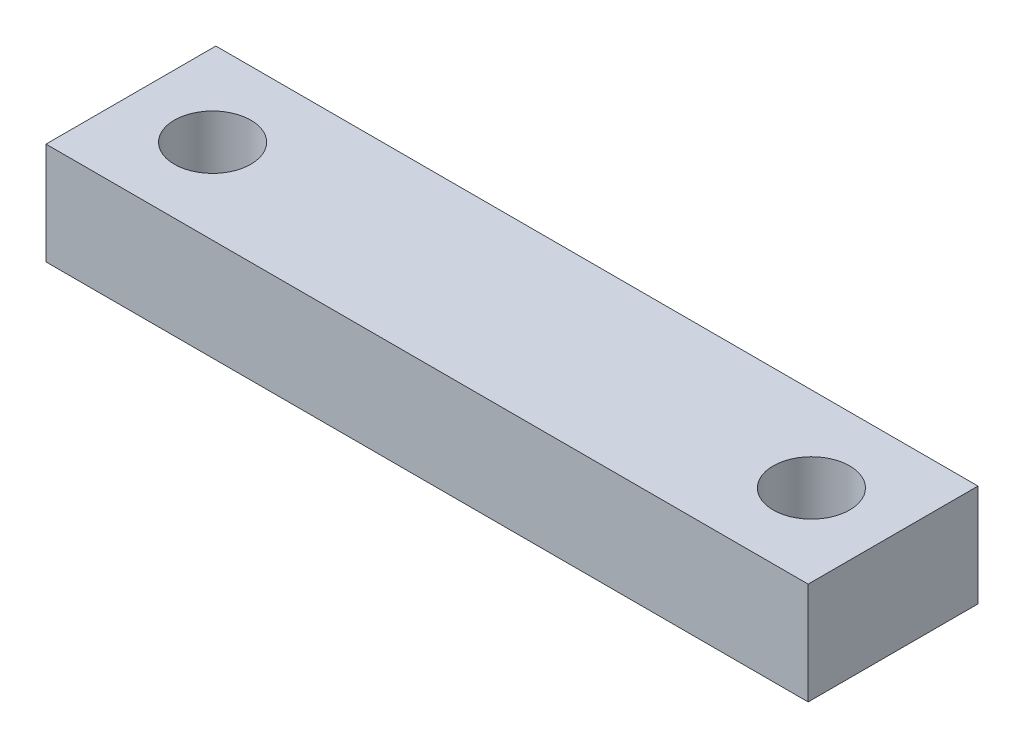
ISO-10303-21;
HEADER;
FILE_DESCRIPTION(('STEP AP214'),'2;1');
FILE_NAME('part.step','',(''),(''),'','','');
FILE_SCHEMA(('AUTOMOTIVE_DESIGN { 1 0 10303 214 1 1 1 1 }'));
ENDSEC;
DATA;
#1=APPLICATION_CONTEXT('core data for automotive mechanical design processes');
#2=APPLICATION_PROTOCOL_DEFINITION('international standard','automotive_design',2000,#1);
#3=PRODUCT_CONTEXT('',#1,'mechanical');
#4=PRODUCT('Part','Part','',(#3));
#5=PRODUCT_RELATED_PRODUCT_CATEGORY('part','',(#4));
#6=PRODUCT_DEFINITION_FORMATION('','',#4);
#7=PRODUCT_DEFINITION_CONTEXT('part definition',#1,'design');
#8=PRODUCT_DEFINITION('design','',#6,#7);
#9=PRODUCT_DEFINITION_SHAPE('','',#8);
#10=(LENGTH_UNIT() NAMED_UNIT(*) SI_UNIT(.MILLI.,.METRE.));
#11=(NAMED_UNIT(*) PLANE_ANGLE_UNIT() SI_UNIT($,.RADIAN.));
#12=(NAMED_UNIT(*) SI_UNIT($,.STERADIAN.) SOLID_ANGLE_UNIT());
#13=UNCERTAINTY_MEASURE_WITH_UNIT(LENGTH_MEASURE(1.E-05),#10,'distance_accuracy_value','');
#14=(GEOMETRIC_REPRESENTATION_CONTEXT(3) GLOBAL_UNCERTAINTY_ASSIGNED_CONTEXT((#13)) GLOBAL_UNIT_ASSIGNED_CONTEXT((#10,
#11,#12)) REPRESENTATION_CONTEXT('',''));
#15=CARTESIAN_POINT('',(0.,0.,0.));
#16=DIRECTION('',(0.,0.,1.));
#17=DIRECTION('',(1.,0.,0.));
#18=AXIS2_PLACEMENT_3D('',#15,#16,#17);
#19=CARTESIAN_POINT('',(35.56,9.525,7.9248));
#20=DIRECTION('',(-1.,0.,0.));
#21=DIRECTION('',(0.,0.,1.));
#22=AXIS2_PLACEMENT_3D('',#19,#20,#21);
#23=PLANE('',#22);
#24=DIRECTION('',(0.,0.,-1.));
#25=VECTOR('',#24,1.);
#26=CARTESIAN_POINT('',(35.56,0.,7.9248));
#27=LINE('',#26,#25);
#28=CARTESIAN_POINT('',(35.56,0.,7.9248));
#29=VERTEX_POINT('',#28);
#30=CARTESIAN_POINT('',(35.56,0.,-7.9248));
#31=VERTEX_POINT('',#30);
#32=EDGE_CURVE('E96',#29,#31,#27,.T.);
#33=ORIENTED_EDGE('',*,*,#32,.T.);
#34=DIRECTION('',(0.,-1.,0.));
#35=VECTOR('',#34,1.);
#36=CARTESIAN_POINT('',(35.56,9.525,-7.9248));
#37=LINE('',#36,#35);
#38=CARTESIAN_POINT('',(35.56,9.525,-7.9248));
#39=VERTEX_POINT('',#38);
#40=EDGE_CURVE('E11',#39,#31,#37,.T.);
#41=ORIENTED_EDGE('',*,*,#40,.F.);
#42=DIRECTION('',(0.,0.,-1.));
#43=VECTOR('',#42,1.);
#44=CARTESIAN_POINT('',(35.56,9.525,7.9248));
#45=LINE('',#44,#43);
#46=CARTESIAN_POINT('',(35.56,9.525,7.9248));
#47=VERTEX_POINT('',#46);
#48=EDGE_CURVE('E84',#47,#39,#45,.T.);
#49=ORIENTED_EDGE('',*,*,#48,.F.);
#50=DIRECTION('',(0.,-1.,0.));
#51=VECTOR('',#50,1.);
#52=CARTESIAN_POINT('',(35.56,9.525,7.9248));
#53=LINE('',#52,#51);
#54=EDGE_CURVE('E92',#47,#29,#53,.T.);
#55=ORIENTED_EDGE('',*,*,#54,.T.);
#56=EDGE_LOOP('',(#33,#41,#49,#55));
#57=FACE_BOUND('',#56,.T.);
#58=ADVANCED_FACE('F33',(#57),#23,.F.);
#59=CARTESIAN_POINT('',(-35.56,9.525,-7.9248));
#60=DIRECTION('',(0.,0.,1.));
#61=DIRECTION('',(1.,0.,0.));
#62=AXIS2_PLACEMENT_3D('',#59,#60,#61);
#63=PLANE('',#62);
#64=DIRECTION('',(-1.,0.,0.));
#65=VECTOR('',#64,1.);
#66=CARTESIAN_POINT('',(-35.56,0.,-7.9248));
#67=LINE('',#66,#65);
#68=CARTESIAN_POINT('',(-35.56,0.,-7.9248));
#69=VERTEX_POINT('',#68);
#70=EDGE_CURVE('E88',#31,#69,#67,.T.);
#71=ORIENTED_EDGE('',*,*,#70,.T.);
#72=DIRECTION('',(0.,-1.,0.));
#73=VECTOR('',#72,1.);
#74=CARTESIAN_POINT('',(-35.56,9.525,-7.9248));
#75=LINE('',#74,#73);
#76=CARTESIAN_POINT('',(-35.56,9.525,-7.9248));
#77=VERTEX_POINT('',#76);
#78=EDGE_CURVE('E41',#77,#69,#75,.T.);
#79=ORIENTED_EDGE('',*,*,#78,.F.);
#80=DIRECTION('',(-1.,0.,0.));
#81=VECTOR('',#80,1.);
#82=CARTESIAN_POINT('',(-35.56,9.525,-7.9248));
#83=LINE('',#82,#81);
#84=EDGE_CURVE('E79',#39,#77,#83,.T.);
#85=ORIENTED_EDGE('',*,*,#84,.F.);
#86=ORIENTED_EDGE('',*,*,#40,.T.);
#87=EDGE_LOOP('',(#71,#79,#85,#86));
#88=FACE_BOUND('',#87,.T.);
#89=ADVANCED_FACE('F87',(#88),#63,.F.);
#90=CARTESIAN_POINT('',(-35.56,9.525,7.9248));
#91=DIRECTION('',(1.,0.,0.));
#92=DIRECTION('',(0.,0.,-1.));
#93=AXIS2_PLACEMENT_3D('',#90,#91,#92);
#94=PLANE('',#93);
#95=DIRECTION('',(0.,0.,1.));
#96=VECTOR('',#95,1.);
#97=CARTESIAN_POINT('',(-35.56,0.,7.9248));
#98=LINE('',#97,#96);
#99=CARTESIAN_POINT('',(-35.56,0.,7.9248));
#100=VERTEX_POINT('',#99);
#101=EDGE_CURVE('E66',#69,#100,#98,.T.);
#102=ORIENTED_EDGE('',*,*,#101,.T.);
#103=DIRECTION('',(0.,-1.,0.));
#104=VECTOR('',#103,1.);
#105=CARTESIAN_POINT('',(-35.56,9.525,7.9248));
#106=LINE('',#105,#104);
#107=CARTESIAN_POINT('',(-35.56,9.525,7.9248));
#108=VERTEX_POINT('',#107);
#109=EDGE_CURVE('E89',#108,#100,#106,.T.);
#110=ORIENTED_EDGE('',*,*,#109,.F.);
#111=DIRECTION('',(0.,0.,1.));
#112=VECTOR('',#111,1.);
#113=CARTESIAN_POINT('',(-35.56,9.525,7.9248));
#114=LINE('',#113,#112);
#115=EDGE_CURVE('E82',#77,#108,#114,.T.);
#116=ORIENTED_EDGE('',*,*,#115,.F.);
#117=ORIENTED_EDGE('',*,*,#78,.T.);
#118=EDGE_LOOP('',(#102,#110,#116,#117));
#119=FACE_BOUND('',#118,.T.);
#120=ADVANCED_FACE('F90',(#119),#94,.F.);
#121=CARTESIAN_POINT('',(-35.56,9.525,7.9248));
#122=DIRECTION('',(0.,0.,-1.));
#123=DIRECTION('',(-1.,0.,0.));
#124=AXIS2_PLACEMENT_3D('',#121,#122,#123);
#125=PLANE('',#124);
#126=DIRECTION('',(1.,0.,0.));
#127=VECTOR('',#126,1.);
#128=CARTESIAN_POINT('',(-35.56,0.,7.9248));
#129=LINE('',#128,#127);
#130=EDGE_CURVE('E72',#100,#29,#129,.T.);
#131=ORIENTED_EDGE('',*,*,#130,.T.);
#132=ORIENTED_EDGE('',*,*,#54,.F.);
#133=DIRECTION('',(1.,0.,0.));
#134=VECTOR('',#133,1.);
#135=CARTESIAN_POINT('',(-35.56,9.525,7.9248));
#136=LINE('',#135,#134);
#137=EDGE_CURVE('E49',#108,#47,#136,.T.);
#138=ORIENTED_EDGE('',*,*,#137,.F.);
#139=ORIENTED_EDGE('',*,*,#109,.T.);
#140=EDGE_LOOP('',(#131,#132,#138,#139));
#141=FACE_BOUND('',#140,.T.);
#142=ADVANCED_FACE('F104',(#141),#125,.F.);
#143=CARTESIAN_POINT('',(0.,9.525,0.));
#144=DIRECTION('',(0.,-1.,0.));
#145=DIRECTION('',(0.,0.,-1.));
#146=AXIS2_PLACEMENT_3D('',#143,#144,#145);
#147=PLANE('',#146);
#148=CARTESIAN_POINT('',(-27.94,9.525,0.));
#149=DIRECTION('',(0.,1.,0.));
#150=DIRECTION('',(0.,0.,1.));
#151=AXIS2_PLACEMENT_3D('',#148,#149,#150);
#152=CIRCLE('',#151,3.5687);
#153=CARTESIAN_POINT('',(-27.94,9.525,3.5687));
#154=VERTEX_POINT('',#153);
#155=EDGE_CURVE('E118',#154,#154,#152,.T.);
#156=ORIENTED_EDGE('',*,*,#155,.F.);
#157=EDGE_LOOP('',(#156));
#158=FACE_BOUND('',#157,.T.);
#159=CARTESIAN_POINT('',(27.94,9.525,0.));
#160=DIRECTION('',(0.,1.,0.));
#161=DIRECTION('',(0.,0.,1.));
#162=AXIS2_PLACEMENT_3D('',#159,#160,#161);
#163=CIRCLE('',#162,3.5687);
#164=CARTESIAN_POINT('',(27.94,9.525,3.5687));
#165=VERTEX_POINT('',#164);
#166=EDGE_CURVE('E112',#165,#165,#163,.T.);
#167=ORIENTED_EDGE('',*,*,#166,.F.);
#168=EDGE_LOOP('',(#167));
#169=FACE_BOUND('',#168,.T.);
#170=ORIENTED_EDGE('',*,*,#48,.T.);
#171=ORIENTED_EDGE('',*,*,#84,.T.);
#172=ORIENTED_EDGE('',*,*,#115,.T.);
#173=ORIENTED_EDGE('',*,*,#137,.T.);
#174=EDGE_LOOP('',(#170,#171,#172,#173));
#175=FACE_BOUND('',#174,.T.);
#176=ADVANCED_FACE('F80',(#158,#169,#175),#147,.F.);
#177=CARTESIAN_POINT('',(0.,0.,0.));
#178=DIRECTION('',(0.,-1.,0.));
#179=DIRECTION('',(0.,0.,-1.));
#180=AXIS2_PLACEMENT_3D('',#177,#178,#179);
#181=PLANE('',#180);
#182=CARTESIAN_POINT('',(-27.94,0.,0.));
#183=DIRECTION('',(0.,-1.,0.));
#184=DIRECTION('',(0.,0.,-1.));
#185=AXIS2_PLACEMENT_3D('',#182,#183,#184);
#186=CIRCLE('',#185,3.5687);
#187=CARTESIAN_POINT('',(-27.94,0.,-3.5687));
#188=VERTEX_POINT('',#187);
#189=EDGE_CURVE('E115',#188,#188,#186,.T.);
#190=ORIENTED_EDGE('',*,*,#189,.F.);
#191=EDGE_LOOP('',(#190));
#192=FACE_BOUND('',#191,.T.);
#193=CARTESIAN_POINT('',(27.94,0.,0.));
#194=DIRECTION('',(0.,-1.,0.));
#195=DIRECTION('',(0.,0.,-1.));
#196=AXIS2_PLACEMENT_3D('',#193,#194,#195);
#197=CIRCLE('',#196,3.5687);
#198=CARTESIAN_POINT('',(27.94,0.,-3.5687));
#199=VERTEX_POINT('',#198);
#200=EDGE_CURVE('E99',#199,#199,#197,.T.);
#201=ORIENTED_EDGE('',*,*,#200,.F.);
#202=EDGE_LOOP('',(#201));
#203=FACE_BOUND('',#202,.T.);
#204=ORIENTED_EDGE('',*,*,#32,.F.);
#205=ORIENTED_EDGE('',*,*,#130,.F.);
#206=ORIENTED_EDGE('',*,*,#101,.F.);
#207=ORIENTED_EDGE('',*,*,#70,.F.);
#208=EDGE_LOOP('',(#204,#205,#206,#207));
#209=FACE_BOUND('',#208,.T.);
#210=ADVANCED_FACE('F107',(#192,#203,#209),#181,.T.);
#211=CARTESIAN_POINT('',(27.94,9.525,0.));
#212=DIRECTION('',(0.,1.,0.));
#213=DIRECTION('',(0.,0.,1.));
#214=AXIS2_PLACEMENT_3D('',#211,#212,#213);
#215=CYLINDRICAL_SURFACE('',#214,3.5687);
#216=ORIENTED_EDGE('',*,*,#166,.T.);
#217=EDGE_LOOP('',(#216));
#218=FACE_BOUND('',#217,.T.);
#219=ORIENTED_EDGE('',*,*,#200,.T.);
#220=EDGE_LOOP('',(#219));
#221=FACE_BOUND('',#220,.T.);
#222=ADVANCED_FACE('F130',(#218,#221),#215,.F.);
#223=CARTESIAN_POINT('',(-27.94,9.525,0.));
#224=DIRECTION('',(0.,1.,0.));
#225=DIRECTION('',(0.,0.,1.));
#226=AXIS2_PLACEMENT_3D('',#223,#224,#225);
#227=CYLINDRICAL_SURFACE('',#226,3.5687);
#228=ORIENTED_EDGE('',*,*,#155,.T.);
#229=EDGE_LOOP('',(#228));
#230=FACE_BOUND('',#229,.T.);
#231=ORIENTED_EDGE('',*,*,#189,.T.);
#232=EDGE_LOOP('',(#231));
#233=FACE_BOUND('',#232,.T.);
#234=ADVANCED_FACE('F122',(#230,#233),#227,.F.);
#235=CLOSED_SHELL('',(#58,#89,#120,#142,#176,#210,#222,#234));
#236=MANIFOLD_SOLID_BREP('B2',#235);
#237=ADVANCED_BREP_SHAPE_REPRESENTATION('',(#18,#236),#14);
#238=SHAPE_DEFINITION_REPRESENTATION(#9,#237);
ENDSEC;
END-ISO-10303-21;
